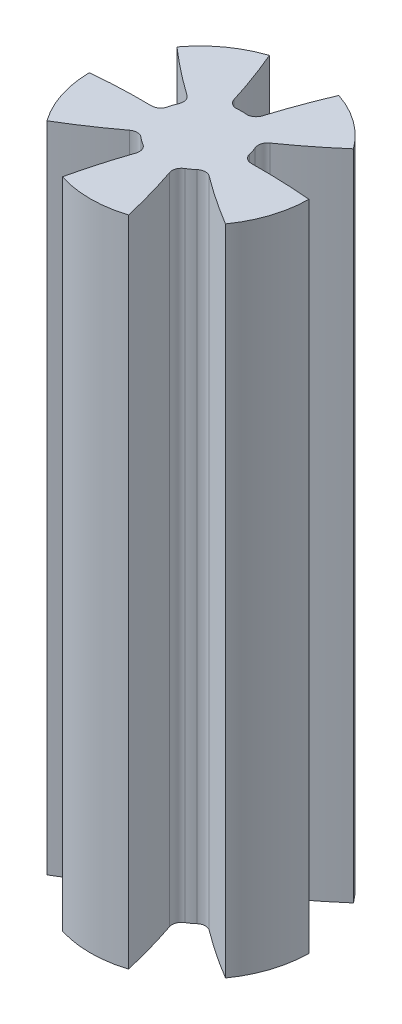
ISO-10303-21;
HEADER;
FILE_DESCRIPTION(('STEP AP214'),'2;1');
FILE_NAME('part.step','',(''),(''),'','','');
FILE_SCHEMA(('AUTOMOTIVE_DESIGN { 1 0 10303 214 1 1 1 1 }'));
ENDSEC;
DATA;
#1=APPLICATION_CONTEXT('core data for automotive mechanical design processes');
#2=APPLICATION_PROTOCOL_DEFINITION('international standard','automotive_design',2000,#1);
#3=PRODUCT_CONTEXT('',#1,'mechanical');
#4=PRODUCT('Part','Part','',(#3));
#5=PRODUCT_RELATED_PRODUCT_CATEGORY('part','',(#4));
#6=PRODUCT_DEFINITION_FORMATION('','',#4);
#7=PRODUCT_DEFINITION_CONTEXT('part definition',#1,'design');
#8=PRODUCT_DEFINITION('design','',#6,#7);
#9=PRODUCT_DEFINITION_SHAPE('','',#8);
#10=(LENGTH_UNIT() NAMED_UNIT(*) SI_UNIT(.MILLI.,.METRE.));
#11=(NAMED_UNIT(*) PLANE_ANGLE_UNIT() SI_UNIT($,.RADIAN.));
#12=(NAMED_UNIT(*) SI_UNIT($,.STERADIAN.) SOLID_ANGLE_UNIT());
#13=UNCERTAINTY_MEASURE_WITH_UNIT(LENGTH_MEASURE(1.E-05),#10,'distance_accuracy_value','');
#14=(GEOMETRIC_REPRESENTATION_CONTEXT(3) GLOBAL_UNCERTAINTY_ASSIGNED_CONTEXT((#13)) GLOBAL_UNIT_ASSIGNED_CONTEXT((#10,
#11,#12)) REPRESENTATION_CONTEXT('',''));
#15=CARTESIAN_POINT('',(0.,0.,0.));
#16=DIRECTION('',(0.,0.,1.));
#17=DIRECTION('',(1.,0.,0.));
#18=AXIS2_PLACEMENT_3D('',#15,#16,#17);
#19=CARTESIAN_POINT('',(0.,15.,0.));
#20=DIRECTION('',(0.,1.,0.));
#21=DIRECTION('',(0.,0.,1.));
#22=AXIS2_PLACEMENT_3D('',#19,#20,#21);
#23=PLANE('',#22);
#24=CARTESIAN_POINT('',(2.68452873255668,15.,26.1539844267962));
#25=DIRECTION('',(0.,-1.,0.));
#26=DIRECTION('',(-0.95105651629515,0.,0.309016994374958));
#27=AXIS2_PLACEMENT_3D('',#24,#25,#26);
#28=CIRCLE('',#27,26.2211974538354);
#29=CARTESIAN_POINT('',(2.30365048912797,15.,-0.0644466413799276));
#30=VERTEX_POINT('',#29);
#31=CARTESIAN_POINT('',(5.03985076594329,15.,0.0387847524290857));
#32=VERTEX_POINT('',#31);
#33=EDGE_CURVE('E376',#30,#32,#28,.T.);
#34=ORIENTED_EDGE('',*,*,#33,.F.);
#35=CARTESIAN_POINT('',(2.2974044873974,15.,-0.494401275571003));
#36=DIRECTION('',(0.,1.,0.));
#37=DIRECTION('',(0.,0.,1.));
#38=AXIS2_PLACEMENT_3D('',#35,#36,#37);
#39=CIRCLE('',#38,0.43);
#40=CARTESIAN_POINT('',(1.87702834715023,15.,-0.403936361317588));
#41=VERTEX_POINT('',#40);
#42=EDGE_CURVE('E350',#30,#41,#39,.F.);
#43=ORIENTED_EDGE('',*,*,#42,.T.);
#44=CARTESIAN_POINT('',(0.,15.,0.));
#45=DIRECTION('',(0.,-1.,0.));
#46=DIRECTION('',(-0.95105651629515,0.,0.309016994374958));
#47=AXIS2_PLACEMENT_3D('',#44,#45,#46);
#48=CIRCLE('',#47,1.92);
#49=CARTESIAN_POINT('',(1.75597566781519,15.,-0.776498199637955));
#50=VERTEX_POINT('',#49);
#51=EDGE_CURVE('E374',#50,#41,#48,.T.);
#52=ORIENTED_EDGE('',*,*,#51,.F.);
#53=CARTESIAN_POINT('',(2.14924105175297,15.,-0.950401442265205));
#54=DIRECTION('',(0.,1.,0.));
#55=DIRECTION('',(0.,0.,1.));
#56=AXIS2_PLACEMENT_3D('',#53,#54,#55);
#57=CIRCLE('',#56,0.43);
#58=CARTESIAN_POINT('',(1.90157318016757,15.,-1.30191335583906));
#59=VERTEX_POINT('',#58);
#60=EDGE_CURVE('E43',#50,#59,#57,.F.);
#61=ORIENTED_EDGE('',*,*,#60,.T.);
#62=CARTESIAN_POINT('',(-13.2010969682322,15.,-22.7369442702478));
#63=DIRECTION('',(0.,-1.,0.));
#64=DIRECTION('',(0.95105651629515,0.,-0.309016994374958));
#65=AXIS2_PLACEMENT_3D('',#62,#63,#64);
#66=CIRCLE('',#65,26.2211974538354);
#67=CARTESIAN_POINT('',(4.05452781327001,15.,-2.99372747781423));
#68=VERTEX_POINT('',#67);
#69=EDGE_CURVE('E380',#68,#59,#66,.T.);
#70=ORIENTED_EDGE('',*,*,#69,.F.);
#71=CARTESIAN_POINT('',(0.,15.,0.));
#72=DIRECTION('',(0.,1.,0.));
#73=DIRECTION('',(0.,0.,1.));
#74=AXIS2_PLACEMENT_3D('',#71,#72,#73);
#75=CIRCLE('',#74,5.04);
#76=CARTESIAN_POINT('',(1.5942860273207,15.,-4.78119776448225));
#77=VERTEX_POINT('',#76);
#78=EDGE_CURVE('E263',#68,#77,#75,.T.);
#79=ORIENTED_EDGE('',*,*,#78,.T.);
#80=CARTESIAN_POINT('',(25.7034823164343,15.,5.52888711421844));
#81=DIRECTION('',(0.,-1.,0.));
#82=DIRECTION('',(0.,0.,1.));
#83=AXIS2_PLACEMENT_3D('',#80,#81,#82);
#84=CIRCLE('',#83,26.2211974538354);
#85=CARTESIAN_POINT('',(0.650574752003009,15.,-2.21081691636845));
#86=VERTEX_POINT('',#85);
#87=EDGE_CURVE('E412',#86,#77,#84,.T.);
#88=ORIENTED_EDGE('',*,*,#87,.F.);
#89=CARTESIAN_POINT('',(0.239733474762643,15.,-2.33773990449711));
#90=DIRECTION('',(0.,1.,0.));
#91=DIRECTION('',(0.,0.,1.));
#92=AXIS2_PLACEMENT_3D('',#89,#90,#91);
#93=CIRCLE('',#92,0.43);
#94=CARTESIAN_POINT('',(0.19586734959331,15.,-1.90998324112106));
#95=VERTEX_POINT('',#94);
#96=EDGE_CURVE('E281',#86,#95,#93,.F.);
#97=ORIENTED_EDGE('',*,*,#96,.T.);
#98=CARTESIAN_POINT('',(0.,15.,0.));
#99=DIRECTION('',(0.,-1.,0.));
#100=DIRECTION('',(0.,0.,1.));
#101=AXIS2_PLACEMENT_3D('',#98,#99,#100);
#102=CIRCLE('',#101,1.92);
#103=CARTESIAN_POINT('',(-0.195867349593315,15.,-1.90998324112106));
#104=VERTEX_POINT('',#103);
#105=EDGE_CURVE('E421',#104,#95,#102,.T.);
#106=ORIENTED_EDGE('',*,*,#105,.F.);
#107=CARTESIAN_POINT('',(-0.239733474762651,15.,-2.33773990449713));
#108=DIRECTION('',(0.,1.,0.));
#109=DIRECTION('',(0.,0.,1.));
#110=AXIS2_PLACEMENT_3D('',#107,#108,#109);
#111=CIRCLE('',#110,0.43);
#112=CARTESIAN_POINT('',(-0.650574752003016,15.,-2.21081691636847));
#113=VERTEX_POINT('',#112);
#114=EDGE_CURVE('E285',#104,#113,#111,.F.);
#115=ORIENTED_EDGE('',*,*,#114,.T.);
#116=CARTESIAN_POINT('',(-25.7034823164343,15.,5.52888711421844));
#117=DIRECTION('',(0.,-1.,0.));
#118=DIRECTION('',(0.,0.,-1.));
#119=AXIS2_PLACEMENT_3D('',#116,#117,#118);
#120=CIRCLE('',#119,26.2211974538354);
#121=CARTESIAN_POINT('',(-1.5942860273207,15.,-4.78119776448225));
#122=VERTEX_POINT('',#121);
#123=EDGE_CURVE('E406',#122,#113,#120,.T.);
#124=ORIENTED_EDGE('',*,*,#123,.F.);
#125=CARTESIAN_POINT('',(-4.05452781327006,15.,-2.99372747781418));
#126=VERTEX_POINT('',#125);
#127=EDGE_CURVE('E269',#122,#126,#75,.T.);
#128=ORIENTED_EDGE('',*,*,#127,.T.);
#129=CARTESIAN_POINT('',(13.2010969682318,15.,-22.736944270248));
#130=DIRECTION('',(0.,-1.,0.));
#131=DIRECTION('',(0.951056516295155,0.,0.309016994374945));
#132=AXIS2_PLACEMENT_3D('',#129,#130,#131);
#133=CIRCLE('',#132,26.2211974538354);
#134=CARTESIAN_POINT('',(-1.90157318016758,15.,-1.30191335583903));
#135=VERTEX_POINT('',#134);
#136=EDGE_CURVE('E392',#135,#126,#133,.T.);
#137=ORIENTED_EDGE('',*,*,#136,.F.);
#138=CARTESIAN_POINT('',(-2.14924105175297,15.,-0.950401442265166));
#139=DIRECTION('',(0.,1.,0.));
#140=DIRECTION('',(0.,0.,1.));
#141=AXIS2_PLACEMENT_3D('',#138,#139,#140);
#142=CIRCLE('',#141,0.43);
#143=CARTESIAN_POINT('',(-1.75597566781521,15.,-0.776498199637929));
#144=VERTEX_POINT('',#143);
#145=EDGE_CURVE('E299',#135,#144,#142,.F.);
#146=ORIENTED_EDGE('',*,*,#145,.T.);
#147=CARTESIAN_POINT('',(0.,15.,0.));
#148=DIRECTION('',(0.,-1.,0.));
#149=DIRECTION('',(0.951056516295155,0.,0.309016994374945));
#150=AXIS2_PLACEMENT_3D('',#147,#148,#149);
#151=CIRCLE('',#150,1.92);
#152=CARTESIAN_POINT('',(-1.87702834715023,15.,-0.403936361317555));
#153=VERTEX_POINT('',#152);
#154=EDGE_CURVE('E399',#153,#144,#151,.T.);
#155=ORIENTED_EDGE('',*,*,#154,.F.);
#156=CARTESIAN_POINT('',(-2.29740448739742,15.,-0.494401275570966));
#157=DIRECTION('',(0.,1.,0.));
#158=DIRECTION('',(0.,0.,1.));
#159=AXIS2_PLACEMENT_3D('',#156,#157,#158);
#160=CIRCLE('',#159,0.43);
#161=CARTESIAN_POINT('',(-2.30365048912799,15.,-0.0644466413798964));
#162=VERTEX_POINT('',#161);
#163=EDGE_CURVE('E303',#153,#162,#160,.F.);
#164=ORIENTED_EDGE('',*,*,#163,.T.);
#165=CARTESIAN_POINT('',(-2.68452873255631,15.,26.1539844267963));
#166=DIRECTION('',(0.,-1.,0.));
#167=DIRECTION('',(-0.951056516295155,0.,-0.309016994374945));
#168=AXIS2_PLACEMENT_3D('',#165,#166,#167);
#169=CIRCLE('',#168,26.2211974538354);
#170=CARTESIAN_POINT('',(-5.03985076594328,15.,0.0387847524291563));
#171=VERTEX_POINT('',#170);
#172=EDGE_CURVE('E254',#171,#162,#169,.T.);
#173=ORIENTED_EDGE('',*,*,#172,.F.);
#174=CARTESIAN_POINT('',(-4.10012202425336,15.,2.93097243013861));
#175=VERTEX_POINT('',#174);
#176=EDGE_CURVE('E441',#171,#175,#75,.T.);
#177=ORIENTED_EDGE('',*,*,#176,.T.);
#178=CARTESIAN_POINT('',(-17.5447557012839,15.,-19.5810914735437));
#179=DIRECTION('',(0.,-1.,0.));
#180=DIRECTION('',(0.587785252292469,0.,-0.809016994374951));
#181=AXIS2_PLACEMENT_3D('',#178,#179,#180);
#182=CIRCLE('',#181,26.2211974538354);
#183=CARTESIAN_POINT('',(-1.82581160944179,15.,1.4061902120525));
#184=VERTEX_POINT('',#183);
#185=EDGE_CURVE('E250',#184,#175,#182,.T.);
#186=ORIENTED_EDGE('',*,*,#185,.F.);
#187=CARTESIAN_POINT('',(-1.56803749476254,15.,1.75035951022033));
#188=DIRECTION('',(0.,1.,0.));
#189=DIRECTION('',(0.,0.,1.));
#190=AXIS2_PLACEMENT_3D('',#187,#188,#189);
#191=CIRCLE('',#190,0.43);
#192=CARTESIAN_POINT('',(-1.28111999572089,15.,1.43008096154172));
#193=VERTEX_POINT('',#192);
#194=EDGE_CURVE('E316',#184,#193,#191,.F.);
#195=ORIENTED_EDGE('',*,*,#194,.T.);
#196=CARTESIAN_POINT('',(0.,15.,0.));
#197=DIRECTION('',(0.,-1.,0.));
#198=DIRECTION('',(0.587785252292469,0.,-0.809016994374951));
#199=AXIS2_PLACEMENT_3D('',#196,#197,#198);
#200=CIRCLE('',#199,1.92);
#201=CARTESIAN_POINT('',(-0.964199966792555,15.,1.66033684053485));
#202=VERTEX_POINT('',#201);
#203=EDGE_CURVE('E466',#202,#193,#200,.T.);
#204=ORIENTED_EDGE('',*,*,#203,.F.);
#205=CARTESIAN_POINT('',(-1.18014058435547,15.,2.03218311211296));
#206=DIRECTION('',(0.,1.,0.));
#207=DIRECTION('',(0.,0.,1.));
#208=AXIS2_PLACEMENT_3D('',#205,#206,#207);
#209=CIRCLE('',#208,0.43);
#210=CARTESIAN_POINT('',(-0.773159548478394,15.,2.17098670153492));
#211=VERTEX_POINT('',#210);
#212=EDGE_CURVE('E319',#202,#211,#209,.F.);
#213=ORIENTED_EDGE('',*,*,#212,.T.);
#214=CARTESIAN_POINT('',(24.0443523159388,15.,10.6351642027769));
#215=DIRECTION('',(0.,-1.,0.));
#216=DIRECTION('',(-0.587785252292469,0.,0.809016994374951));
#217=AXIS2_PLACEMENT_3D('',#214,#215,#216);
#218=CIRCLE('',#217,26.2211974538354);
#219=CARTESIAN_POINT('',(-1.52051304425941,15.,4.80516805972871));
#220=VERTEX_POINT('',#219);
#221=EDGE_CURVE('E454',#220,#211,#218,.T.);
#222=ORIENTED_EDGE('',*,*,#221,.F.);
#223=CARTESIAN_POINT('',(1.52051304425948,15.,4.8051680597287));
#224=VERTEX_POINT('',#223);
#225=EDGE_CURVE('E442',#220,#224,#75,.T.);
#226=ORIENTED_EDGE('',*,*,#225,.T.);
#227=CARTESIAN_POINT('',(-24.0443523159387,15.,10.6351642027773));
#228=DIRECTION('',(0.,-1.,0.));
#229=DIRECTION('',(-0.58778525229248,0.,-0.809016994374942));
#230=AXIS2_PLACEMENT_3D('',#227,#228,#229);
#231=CIRCLE('',#230,26.2211974538354);
#232=CARTESIAN_POINT('',(0.773159548478414,15.,2.17098670153489));
#233=VERTEX_POINT('',#232);
#234=EDGE_CURVE('E452',#233,#224,#231,.T.);
#235=ORIENTED_EDGE('',*,*,#234,.F.);
#236=CARTESIAN_POINT('',(1.1801405843555,15.,2.03218311211293));
#237=DIRECTION('',(0.,1.,0.));
#238=DIRECTION('',(0.,0.,1.));
#239=AXIS2_PLACEMENT_3D('',#236,#237,#238);
#240=CIRCLE('',#239,0.43);
#241=CARTESIAN_POINT('',(0.964199966792582,15.,1.66033684053483));
#242=VERTEX_POINT('',#241);
#243=EDGE_CURVE('E333',#233,#242,#240,.F.);
#244=ORIENTED_EDGE('',*,*,#243,.T.);
#245=CARTESIAN_POINT('',(0.,15.,0.));
#246=DIRECTION('',(0.,-1.,0.));
#247=DIRECTION('',(-0.58778525229248,0.,-0.809016994374942));
#248=AXIS2_PLACEMENT_3D('',#245,#246,#247);
#249=CIRCLE('',#248,1.92);
#250=CARTESIAN_POINT('',(1.28111999572092,15.,1.4300809615417));
#251=VERTEX_POINT('',#250);
#252=EDGE_CURVE('E552',#251,#242,#249,.T.);
#253=ORIENTED_EDGE('',*,*,#252,.F.);
#254=CARTESIAN_POINT('',(1.56803749476258,15.,1.75035951022031));
#255=DIRECTION('',(0.,1.,0.));
#256=DIRECTION('',(0.,0.,1.));
#257=AXIS2_PLACEMENT_3D('',#254,#255,#256);
#258=CIRCLE('',#257,0.43);
#259=CARTESIAN_POINT('',(1.82581160944182,15.,1.40619021205249));
#260=VERTEX_POINT('',#259);
#261=EDGE_CURVE('E337',#251,#260,#258,.F.);
#262=ORIENTED_EDGE('',*,*,#261,.T.);
#263=CARTESIAN_POINT('',(17.5447557012836,15.,-19.581091473544));
#264=DIRECTION('',(0.,-1.,0.));
#265=DIRECTION('',(0.58778525229248,0.,0.809016994374942));
#266=AXIS2_PLACEMENT_3D('',#263,#264,#265);
#267=CIRCLE('',#266,26.2211974538354);
#268=CARTESIAN_POINT('',(4.1001220242534,15.,2.93097243013855));
#269=VERTEX_POINT('',#268);
#270=EDGE_CURVE('E387',#269,#260,#267,.T.);
#271=ORIENTED_EDGE('',*,*,#270,.F.);
#272=EDGE_CURVE('E443',#269,#32,#75,.T.);
#273=ORIENTED_EDGE('',*,*,#272,.T.);
#274=EDGE_LOOP('',(#34,#43,#52,#61,#70,#79,#88,#97,#106,#115,#124,#128,#137,#146,#155,#164,#173,
#177,#186,#195,#204,#213,#222,#226,#235,#244,#253,#262,#271,#273));
#275=FACE_BOUND('',#274,.T.);
#276=ADVANCED_FACE('F35',(#275),#23,.T.);
#277=CARTESIAN_POINT('',(0.,-15.,0.));
#278=DIRECTION('',(0.,1.,0.));
#279=DIRECTION('',(0.,0.,1.));
#280=AXIS2_PLACEMENT_3D('',#277,#278,#279);
#281=PLANE('',#280);
#282=CARTESIAN_POINT('',(-13.2010969682322,-15.,-22.7369442702478));
#283=DIRECTION('',(0.,-1.,0.));
#284=DIRECTION('',(0.95105651629515,0.,-0.309016994374958));
#285=AXIS2_PLACEMENT_3D('',#282,#283,#284);
#286=CIRCLE('',#285,26.2211974538354);
#287=CARTESIAN_POINT('',(4.05452781327001,-15.,-2.99372747781423));
#288=VERTEX_POINT('',#287);
#289=CARTESIAN_POINT('',(1.90157318016757,-15.,-1.30191335583906));
#290=VERTEX_POINT('',#289);
#291=EDGE_CURVE('E382',#288,#290,#286,.T.);
#292=ORIENTED_EDGE('',*,*,#291,.T.);
#293=CARTESIAN_POINT('',(2.14924105175297,-15.,-0.950401442265205));
#294=DIRECTION('',(0.,1.,0.));
#295=DIRECTION('',(0.,0.,1.));
#296=AXIS2_PLACEMENT_3D('',#293,#294,#295);
#297=CIRCLE('',#296,0.43);
#298=CARTESIAN_POINT('',(1.75597566781519,-15.,-0.776498199637955));
#299=VERTEX_POINT('',#298);
#300=EDGE_CURVE('E11',#290,#299,#297,.T.);
#301=ORIENTED_EDGE('',*,*,#300,.T.);
#302=CARTESIAN_POINT('',(0.,-15.,0.));
#303=DIRECTION('',(0.,-1.,0.));
#304=DIRECTION('',(-0.95105651629515,0.,0.309016994374958));
#305=AXIS2_PLACEMENT_3D('',#302,#303,#304);
#306=CIRCLE('',#305,1.92);
#307=CARTESIAN_POINT('',(1.87702834715023,-15.,-0.403936361317588));
#308=VERTEX_POINT('',#307);
#309=EDGE_CURVE('E360',#299,#308,#306,.T.);
#310=ORIENTED_EDGE('',*,*,#309,.T.);
#311=CARTESIAN_POINT('',(2.2974044873974,-15.,-0.494401275571003));
#312=DIRECTION('',(0.,1.,0.));
#313=DIRECTION('',(0.,0.,1.));
#314=AXIS2_PLACEMENT_3D('',#311,#312,#313);
#315=CIRCLE('',#314,0.43);
#316=CARTESIAN_POINT('',(2.30365048912797,-15.,-0.0644466413799276));
#317=VERTEX_POINT('',#316);
#318=EDGE_CURVE('E352',#308,#317,#315,.T.);
#319=ORIENTED_EDGE('',*,*,#318,.T.);
#320=CARTESIAN_POINT('',(2.68452873255668,-15.,26.1539844267962));
#321=DIRECTION('',(0.,-1.,0.));
#322=DIRECTION('',(-0.95105651629515,0.,0.309016994374958));
#323=AXIS2_PLACEMENT_3D('',#320,#321,#322);
#324=CIRCLE('',#323,26.2211974538354);
#325=CARTESIAN_POINT('',(5.03985076594329,-15.,0.0387847524290857));
#326=VERTEX_POINT('',#325);
#327=EDGE_CURVE('E357',#317,#326,#324,.T.);
#328=ORIENTED_EDGE('',*,*,#327,.T.);
#329=CARTESIAN_POINT('',(0.,-15.,0.));
#330=DIRECTION('',(0.,1.,0.));
#331=DIRECTION('',(0.,0.,1.));
#332=AXIS2_PLACEMENT_3D('',#329,#330,#331);
#333=CIRCLE('',#332,5.04);
#334=CARTESIAN_POINT('',(4.10012202425339,-15.,2.93097243013854));
#335=VERTEX_POINT('',#334);
#336=EDGE_CURVE('E266',#335,#326,#333,.T.);
#337=ORIENTED_EDGE('',*,*,#336,.F.);
#338=CARTESIAN_POINT('',(17.5447557012836,-15.,-19.581091473544));
#339=DIRECTION('',(0.,-1.,0.));
#340=DIRECTION('',(0.58778525229248,0.,0.809016994374942));
#341=AXIS2_PLACEMENT_3D('',#338,#339,#340);
#342=CIRCLE('',#341,26.2211974538354);
#343=CARTESIAN_POINT('',(1.82581160944182,-15.,1.40619021205249));
#344=VERTEX_POINT('',#343);
#345=EDGE_CURVE('E540',#335,#344,#342,.T.);
#346=ORIENTED_EDGE('',*,*,#345,.T.);
#347=CARTESIAN_POINT('',(1.56803749476258,-15.,1.75035951022031));
#348=DIRECTION('',(0.,1.,0.));
#349=DIRECTION('',(0.,0.,1.));
#350=AXIS2_PLACEMENT_3D('',#347,#348,#349);
#351=CIRCLE('',#350,0.43);
#352=CARTESIAN_POINT('',(1.28111999572092,-15.,1.4300809615417));
#353=VERTEX_POINT('',#352);
#354=EDGE_CURVE('E339',#344,#353,#351,.T.);
#355=ORIENTED_EDGE('',*,*,#354,.T.);
#356=CARTESIAN_POINT('',(0.,-15.,0.));
#357=DIRECTION('',(0.,-1.,0.));
#358=DIRECTION('',(-0.58778525229248,0.,-0.809016994374942));
#359=AXIS2_PLACEMENT_3D('',#356,#357,#358);
#360=CIRCLE('',#359,1.92);
#361=CARTESIAN_POINT('',(0.964199966792582,-15.,1.66033684053483));
#362=VERTEX_POINT('',#361);
#363=EDGE_CURVE('E538',#353,#362,#360,.T.);
#364=ORIENTED_EDGE('',*,*,#363,.T.);
#365=CARTESIAN_POINT('',(1.1801405843555,-15.,2.03218311211293));
#366=DIRECTION('',(0.,1.,0.));
#367=DIRECTION('',(0.,0.,1.));
#368=AXIS2_PLACEMENT_3D('',#365,#366,#367);
#369=CIRCLE('',#368,0.43);
#370=CARTESIAN_POINT('',(0.773159548478414,-15.,2.17098670153489));
#371=VERTEX_POINT('',#370);
#372=EDGE_CURVE('E335',#362,#371,#369,.T.);
#373=ORIENTED_EDGE('',*,*,#372,.T.);
#374=CARTESIAN_POINT('',(-24.0443523159387,-15.,10.6351642027773));
#375=DIRECTION('',(0.,-1.,0.));
#376=DIRECTION('',(-0.58778525229248,0.,-0.809016994374942));
#377=AXIS2_PLACEMENT_3D('',#374,#375,#376);
#378=CIRCLE('',#377,26.2211974538354);
#379=CARTESIAN_POINT('',(1.52051304425948,-15.,4.8051680597287));
#380=VERTEX_POINT('',#379);
#381=EDGE_CURVE('E468',#371,#380,#378,.T.);
#382=ORIENTED_EDGE('',*,*,#381,.T.);
#383=CARTESIAN_POINT('',(-1.52051304425941,-15.,4.80516805972871));
#384=VERTEX_POINT('',#383);
#385=EDGE_CURVE('E260',#384,#380,#333,.T.);
#386=ORIENTED_EDGE('',*,*,#385,.F.);
#387=CARTESIAN_POINT('',(24.0443523159388,-15.,10.6351642027769));
#388=DIRECTION('',(0.,-1.,0.));
#389=DIRECTION('',(-0.587785252292469,0.,0.809016994374951));
#390=AXIS2_PLACEMENT_3D('',#387,#388,#389);
#391=CIRCLE('',#390,26.2211974538354);
#392=CARTESIAN_POINT('',(-0.773159548478394,-15.,2.17098670153492));
#393=VERTEX_POINT('',#392);
#394=EDGE_CURVE('E751',#384,#393,#391,.T.);
#395=ORIENTED_EDGE('',*,*,#394,.T.);
#396=CARTESIAN_POINT('',(-1.18014058435547,-15.,2.03218311211296));
#397=DIRECTION('',(0.,1.,0.));
#398=DIRECTION('',(0.,0.,1.));
#399=AXIS2_PLACEMENT_3D('',#396,#397,#398);
#400=CIRCLE('',#399,0.43);
#401=CARTESIAN_POINT('',(-0.964199966792555,-15.,1.66033684053485));
#402=VERTEX_POINT('',#401);
#403=EDGE_CURVE('E321',#393,#402,#400,.T.);
#404=ORIENTED_EDGE('',*,*,#403,.T.);
#405=CARTESIAN_POINT('',(0.,-15.,0.));
#406=DIRECTION('',(0.,-1.,0.));
#407=DIRECTION('',(0.587785252292469,0.,-0.809016994374951));
#408=AXIS2_PLACEMENT_3D('',#405,#406,#407);
#409=CIRCLE('',#408,1.92);
#410=CARTESIAN_POINT('',(-1.28111999572089,-15.,1.43008096154172));
#411=VERTEX_POINT('',#410);
#412=EDGE_CURVE('E244',#402,#411,#409,.T.);
#413=ORIENTED_EDGE('',*,*,#412,.T.);
#414=CARTESIAN_POINT('',(-1.56803749476254,-15.,1.75035951022033));
#415=DIRECTION('',(0.,1.,0.));
#416=DIRECTION('',(0.,0.,1.));
#417=AXIS2_PLACEMENT_3D('',#414,#415,#416);
#418=CIRCLE('',#417,0.43);
#419=CARTESIAN_POINT('',(-1.82581160944179,-15.,1.4061902120525));
#420=VERTEX_POINT('',#419);
#421=EDGE_CURVE('E239',#411,#420,#418,.T.);
#422=ORIENTED_EDGE('',*,*,#421,.T.);
#423=CARTESIAN_POINT('',(-17.5447557012839,-15.,-19.5810914735437));
#424=DIRECTION('',(0.,-1.,0.));
#425=DIRECTION('',(0.587785252292469,0.,-0.809016994374951));
#426=AXIS2_PLACEMENT_3D('',#423,#424,#425);
#427=CIRCLE('',#426,26.2211974538354);
#428=CARTESIAN_POINT('',(-4.10012202425336,-15.,2.93097243013861));
#429=VERTEX_POINT('',#428);
#430=EDGE_CURVE('E231',#420,#429,#427,.T.);
#431=ORIENTED_EDGE('',*,*,#430,.T.);
#432=CARTESIAN_POINT('',(-5.03985076594327,-15.,0.0387847524291563));
#433=VERTEX_POINT('',#432);
#434=EDGE_CURVE('E236',#433,#429,#333,.T.);
#435=ORIENTED_EDGE('',*,*,#434,.F.);
#436=CARTESIAN_POINT('',(-2.68452873255631,-15.,26.1539844267963));
#437=DIRECTION('',(0.,-1.,0.));
#438=DIRECTION('',(-0.951056516295155,0.,-0.309016994374945));
#439=AXIS2_PLACEMENT_3D('',#436,#437,#438);
#440=CIRCLE('',#439,26.2211974538354);
#441=CARTESIAN_POINT('',(-2.30365048912799,-15.,-0.0644466413798964));
#442=VERTEX_POINT('',#441);
#443=EDGE_CURVE('E389',#433,#442,#440,.T.);
#444=ORIENTED_EDGE('',*,*,#443,.T.);
#445=CARTESIAN_POINT('',(-2.29740448739742,-15.,-0.494401275570966));
#446=DIRECTION('',(0.,1.,0.));
#447=DIRECTION('',(0.,0.,1.));
#448=AXIS2_PLACEMENT_3D('',#445,#446,#447);
#449=CIRCLE('',#448,0.43);
#450=CARTESIAN_POINT('',(-1.87702834715023,-15.,-0.403936361317555));
#451=VERTEX_POINT('',#450);
#452=EDGE_CURVE('E305',#442,#451,#449,.T.);
#453=ORIENTED_EDGE('',*,*,#452,.T.);
#454=CARTESIAN_POINT('',(0.,-15.,0.));
#455=DIRECTION('',(0.,-1.,0.));
#456=DIRECTION('',(0.951056516295155,0.,0.309016994374945));
#457=AXIS2_PLACEMENT_3D('',#454,#455,#456);
#458=CIRCLE('',#457,1.92);
#459=CARTESIAN_POINT('',(-1.75597566781521,-15.,-0.776498199637929));
#460=VERTEX_POINT('',#459);
#461=EDGE_CURVE('E391',#451,#460,#458,.T.);
#462=ORIENTED_EDGE('',*,*,#461,.T.);
#463=CARTESIAN_POINT('',(-2.14924105175297,-15.,-0.950401442265166));
#464=DIRECTION('',(0.,1.,0.));
#465=DIRECTION('',(0.,0.,1.));
#466=AXIS2_PLACEMENT_3D('',#463,#464,#465);
#467=CIRCLE('',#466,0.43);
#468=CARTESIAN_POINT('',(-1.90157318016758,-15.,-1.30191335583903));
#469=VERTEX_POINT('',#468);
#470=EDGE_CURVE('E301',#460,#469,#467,.T.);
#471=ORIENTED_EDGE('',*,*,#470,.T.);
#472=CARTESIAN_POINT('',(13.2010969682318,-15.,-22.736944270248));
#473=DIRECTION('',(0.,-1.,0.));
#474=DIRECTION('',(0.951056516295155,0.,0.309016994374945));
#475=AXIS2_PLACEMENT_3D('',#472,#473,#474);
#476=CIRCLE('',#475,26.2211974538354);
#477=CARTESIAN_POINT('',(-4.05452781327006,-15.,-2.99372747781418));
#478=VERTEX_POINT('',#477);
#479=EDGE_CURVE('E395',#469,#478,#476,.T.);
#480=ORIENTED_EDGE('',*,*,#479,.T.);
#481=CARTESIAN_POINT('',(-1.5942860273207,-15.,-4.78119776448225));
#482=VERTEX_POINT('',#481);
#483=EDGE_CURVE('E259',#482,#478,#333,.T.);
#484=ORIENTED_EDGE('',*,*,#483,.F.);
#485=CARTESIAN_POINT('',(-25.7034823164343,-15.,5.52888711421844));
#486=DIRECTION('',(0.,-1.,0.));
#487=DIRECTION('',(0.,0.,-1.));
#488=AXIS2_PLACEMENT_3D('',#485,#486,#487);
#489=CIRCLE('',#488,26.2211974538354);
#490=CARTESIAN_POINT('',(-0.650574752003016,-15.,-2.21081691636847));
#491=VERTEX_POINT('',#490);
#492=EDGE_CURVE('E408',#482,#491,#489,.T.);
#493=ORIENTED_EDGE('',*,*,#492,.T.);
#494=CARTESIAN_POINT('',(-0.239733474762651,-15.,-2.33773990449713));
#495=DIRECTION('',(0.,1.,0.));
#496=DIRECTION('',(0.,0.,1.));
#497=AXIS2_PLACEMENT_3D('',#494,#495,#496);
#498=CIRCLE('',#497,0.43);
#499=CARTESIAN_POINT('',(-0.195867349593315,-15.,-1.90998324112106));
#500=VERTEX_POINT('',#499);
#501=EDGE_CURVE('E287',#491,#500,#498,.T.);
#502=ORIENTED_EDGE('',*,*,#501,.T.);
#503=CARTESIAN_POINT('',(0.,-15.,0.));
#504=DIRECTION('',(0.,-1.,0.));
#505=DIRECTION('',(0.,0.,1.));
#506=AXIS2_PLACEMENT_3D('',#503,#504,#505);
#507=CIRCLE('',#506,1.92);
#508=CARTESIAN_POINT('',(0.19586734959331,-15.,-1.90998324112106));
#509=VERTEX_POINT('',#508);
#510=EDGE_CURVE('E411',#500,#509,#507,.T.);
#511=ORIENTED_EDGE('',*,*,#510,.T.);
#512=CARTESIAN_POINT('',(0.239733474762643,-15.,-2.33773990449711));
#513=DIRECTION('',(0.,1.,0.));
#514=DIRECTION('',(0.,0.,1.));
#515=AXIS2_PLACEMENT_3D('',#512,#513,#514);
#516=CIRCLE('',#515,0.43);
#517=CARTESIAN_POINT('',(0.650574752003009,-15.,-2.21081691636845));
#518=VERTEX_POINT('',#517);
#519=EDGE_CURVE('E283',#509,#518,#516,.T.);
#520=ORIENTED_EDGE('',*,*,#519,.T.);
#521=CARTESIAN_POINT('',(25.7034823164343,-15.,5.52888711421844));
#522=DIRECTION('',(0.,-1.,0.));
#523=DIRECTION('',(0.,0.,1.));
#524=AXIS2_PLACEMENT_3D('',#521,#522,#523);
#525=CIRCLE('',#524,26.2211974538354);
#526=CARTESIAN_POINT('',(1.5942860273207,-15.,-4.78119776448225));
#527=VERTEX_POINT('',#526);
#528=EDGE_CURVE('E415',#518,#527,#525,.T.);
#529=ORIENTED_EDGE('',*,*,#528,.T.);
#530=EDGE_CURVE('E264',#288,#527,#333,.T.);
#531=ORIENTED_EDGE('',*,*,#530,.F.);
#532=EDGE_LOOP('',(#292,#301,#310,#319,#328,#337,#346,#355,#364,#373,#382,#386,#395,#404,#413,
#422,#431,#435,#444,#453,#462,#471,#480,#484,#493,#502,#511,#520,#529,#531));
#533=FACE_BOUND('',#532,.T.);
#534=ADVANCED_FACE('F233',(#533),#281,.F.);
#535=CARTESIAN_POINT('',(0.,15.,0.));
#536=DIRECTION('',(0.,-1.,0.));
#537=DIRECTION('',(0.,0.,-1.));
#538=AXIS2_PLACEMENT_3D('',#535,#536,#537);
#539=CYLINDRICAL_SURFACE('',#538,5.04);
#540=ORIENTED_EDGE('',*,*,#336,.T.);
#541=DIRECTION('',(0.,1.,0.));
#542=VECTOR('',#541,1.);
#543=CARTESIAN_POINT('',(5.03985076594329,-15.,0.0387847524290857));
#544=LINE('',#543,#542);
#545=EDGE_CURVE('E368',#326,#32,#544,.T.);
#546=ORIENTED_EDGE('',*,*,#545,.T.);
#547=ORIENTED_EDGE('',*,*,#272,.F.);
#548=DIRECTION('',(0.,1.,0.));
#549=VECTOR('',#548,1.);
#550=CARTESIAN_POINT('',(4.1001220242534,-15.,2.93097243013855));
#551=LINE('',#550,#549);
#552=EDGE_CURVE('E464',#335,#269,#551,.T.);
#553=ORIENTED_EDGE('',*,*,#552,.F.);
#554=EDGE_LOOP('',(#540,#546,#547,#553));
#555=FACE_BOUND('',#554,.T.);
#556=ADVANCED_FACE('F488',(#555),#539,.T.);
#557=ORIENTED_EDGE('',*,*,#385,.T.);
#558=DIRECTION('',(0.,1.,0.));
#559=VECTOR('',#558,1.);
#560=CARTESIAN_POINT('',(1.52051304425948,-15.,4.8051680597287));
#561=LINE('',#560,#559);
#562=EDGE_CURVE('E461',#380,#224,#561,.T.);
#563=ORIENTED_EDGE('',*,*,#562,.T.);
#564=ORIENTED_EDGE('',*,*,#225,.F.);
#565=DIRECTION('',(0.,1.,0.));
#566=VECTOR('',#565,1.);
#567=CARTESIAN_POINT('',(-1.52051304425941,-15.,4.80516805972871));
#568=LINE('',#567,#566);
#569=EDGE_CURVE('E243',#384,#220,#568,.T.);
#570=ORIENTED_EDGE('',*,*,#569,.F.);
#571=EDGE_LOOP('',(#557,#563,#564,#570));
#572=FACE_BOUND('',#571,.T.);
#573=ADVANCED_FACE('F458',(#572),#539,.T.);
#574=ORIENTED_EDGE('',*,*,#434,.T.);
#575=DIRECTION('',(0.,1.,0.));
#576=VECTOR('',#575,1.);
#577=CARTESIAN_POINT('',(-4.10012202425336,-15.,2.93097243013861));
#578=LINE('',#577,#576);
#579=EDGE_CURVE('E247',#429,#175,#578,.T.);
#580=ORIENTED_EDGE('',*,*,#579,.T.);
#581=ORIENTED_EDGE('',*,*,#176,.F.);
#582=DIRECTION('',(0.,1.,0.));
#583=VECTOR('',#582,1.);
#584=CARTESIAN_POINT('',(-5.03985076594328,-15.,0.0387847524291563));
#585=LINE('',#584,#583);
#586=EDGE_CURVE('E258',#433,#171,#585,.T.);
#587=ORIENTED_EDGE('',*,*,#586,.F.);
#588=EDGE_LOOP('',(#574,#580,#581,#587));
#589=FACE_BOUND('',#588,.T.);
#590=ADVANCED_FACE('F257',(#589),#539,.T.);
#591=ORIENTED_EDGE('',*,*,#483,.T.);
#592=DIRECTION('',(0.,1.,0.));
#593=VECTOR('',#592,1.);
#594=CARTESIAN_POINT('',(-4.05452781327006,-15.,-2.99372747781418));
#595=LINE('',#594,#593);
#596=EDGE_CURVE('E403',#478,#126,#595,.T.);
#597=ORIENTED_EDGE('',*,*,#596,.T.);
#598=ORIENTED_EDGE('',*,*,#127,.F.);
#599=DIRECTION('',(0.,1.,0.));
#600=VECTOR('',#599,1.);
#601=CARTESIAN_POINT('',(-1.5942860273207,-15.,-4.78119776448225));
#602=LINE('',#601,#600);
#603=EDGE_CURVE('E418',#482,#122,#602,.T.);
#604=ORIENTED_EDGE('',*,*,#603,.F.);
#605=EDGE_LOOP('',(#591,#597,#598,#604));
#606=FACE_BOUND('',#605,.T.);
#607=ADVANCED_FACE('F439',(#606),#539,.T.);
#608=ORIENTED_EDGE('',*,*,#78,.F.);
#609=DIRECTION('',(0.,1.,0.));
#610=VECTOR('',#609,1.);
#611=CARTESIAN_POINT('',(4.05452781327001,-15.,-2.99372747781423));
#612=LINE('',#611,#610);
#613=EDGE_CURVE('E370',#288,#68,#612,.T.);
#614=ORIENTED_EDGE('',*,*,#613,.F.);
#615=ORIENTED_EDGE('',*,*,#530,.T.);
#616=DIRECTION('',(0.,1.,0.));
#617=VECTOR('',#616,1.);
#618=CARTESIAN_POINT('',(1.5942860273207,-15.,-4.78119776448225));
#619=LINE('',#618,#617);
#620=EDGE_CURVE('E426',#527,#77,#619,.T.);
#621=ORIENTED_EDGE('',*,*,#620,.T.);
#622=EDGE_LOOP('',(#608,#614,#615,#621));
#623=FACE_BOUND('',#622,.T.);
#624=ADVANCED_FACE('F493',(#623),#539,.T.);
#625=CARTESIAN_POINT('',(25.7034823164343,-15.,5.52888711421844));
#626=DIRECTION('',(0.,1.,0.));
#627=DIRECTION('',(0.,0.,1.));
#628=AXIS2_PLACEMENT_3D('',#625,#626,#627);
#629=CYLINDRICAL_SURFACE('',#628,26.2211974538354);
#630=ORIENTED_EDGE('',*,*,#528,.F.);
#631=DIRECTION('',(0.,1.,0.));
#632=VECTOR('',#631,1.);
#633=CARTESIAN_POINT('',(0.650574752003006,-15.,-2.21081691636845));
#634=LINE('',#633,#632);
#635=EDGE_CURVE('E271',#518,#86,#634,.T.);
#636=ORIENTED_EDGE('',*,*,#635,.T.);
#637=ORIENTED_EDGE('',*,*,#87,.T.);
#638=ORIENTED_EDGE('',*,*,#620,.F.);
#639=EDGE_LOOP('',(#630,#636,#637,#638));
#640=FACE_BOUND('',#639,.T.);
#641=ADVANCED_FACE('F496',(#640),#629,.T.);
#642=CARTESIAN_POINT('',(0.,-15.,0.));
#643=DIRECTION('',(0.,1.,0.));
#644=DIRECTION('',(0.,0.,1.));
#645=AXIS2_PLACEMENT_3D('',#642,#643,#644);
#646=CYLINDRICAL_SURFACE('',#645,1.92);
#647=ORIENTED_EDGE('',*,*,#105,.T.);
#648=DIRECTION('',(0.,1.,0.));
#649=VECTOR('',#648,1.);
#650=CARTESIAN_POINT('',(0.19586734959331,-15.,-1.90998324112106));
#651=LINE('',#650,#649);
#652=EDGE_CURVE('E277',#95,#509,#651,.F.);
#653=ORIENTED_EDGE('',*,*,#652,.T.);
#654=ORIENTED_EDGE('',*,*,#510,.F.);
#655=DIRECTION('',(0.,1.,0.));
#656=VECTOR('',#655,1.);
#657=CARTESIAN_POINT('',(-0.195867349593315,-15.,-1.90998324112106));
#658=LINE('',#657,#656);
#659=EDGE_CURVE('E274',#500,#104,#658,.T.);
#660=ORIENTED_EDGE('',*,*,#659,.T.);
#661=EDGE_LOOP('',(#647,#653,#654,#660));
#662=FACE_BOUND('',#661,.T.);
#663=ADVANCED_FACE('F566',(#662),#646,.T.);
#664=CARTESIAN_POINT('',(-25.7034823164343,-15.,5.52888711421844));
#665=DIRECTION('',(0.,1.,0.));
#666=DIRECTION('',(0.,0.,1.));
#667=AXIS2_PLACEMENT_3D('',#664,#665,#666);
#668=CYLINDRICAL_SURFACE('',#667,26.2211974538354);
#669=ORIENTED_EDGE('',*,*,#123,.T.);
#670=DIRECTION('',(0.,1.,0.));
#671=VECTOR('',#670,1.);
#672=CARTESIAN_POINT('',(-0.650574752003016,-15.,-2.21081691636847));
#673=LINE('',#672,#671);
#674=EDGE_CURVE('E279',#113,#491,#673,.F.);
#675=ORIENTED_EDGE('',*,*,#674,.T.);
#676=ORIENTED_EDGE('',*,*,#492,.F.);
#677=ORIENTED_EDGE('',*,*,#603,.T.);
#678=EDGE_LOOP('',(#669,#675,#676,#677));
#679=FACE_BOUND('',#678,.T.);
#680=ADVANCED_FACE('F431',(#679),#668,.T.);
#681=CARTESIAN_POINT('',(0.239733474762643,-15.,-2.33773990449711));
#682=DIRECTION('',(0.,-1.,0.));
#683=DIRECTION('',(0.,0.,-1.));
#684=AXIS2_PLACEMENT_3D('',#681,#682,#683);
#685=CYLINDRICAL_SURFACE('',#684,0.43);
#686=ORIENTED_EDGE('',*,*,#519,.F.);
#687=ORIENTED_EDGE('',*,*,#652,.F.);
#688=ORIENTED_EDGE('',*,*,#96,.F.);
#689=ORIENTED_EDGE('',*,*,#635,.F.);
#690=EDGE_LOOP('',(#686,#687,#688,#689));
#691=FACE_BOUND('',#690,.T.);
#692=ADVANCED_FACE('F498',(#691),#685,.F.);
#693=CARTESIAN_POINT('',(-0.239733474762651,-15.,-2.33773990449713));
#694=DIRECTION('',(0.,-1.,0.));
#695=DIRECTION('',(0.,0.,-1.));
#696=AXIS2_PLACEMENT_3D('',#693,#694,#695);
#697=CYLINDRICAL_SURFACE('',#696,0.43);
#698=ORIENTED_EDGE('',*,*,#501,.F.);
#699=ORIENTED_EDGE('',*,*,#674,.F.);
#700=ORIENTED_EDGE('',*,*,#114,.F.);
#701=ORIENTED_EDGE('',*,*,#659,.F.);
#702=EDGE_LOOP('',(#698,#699,#700,#701));
#703=FACE_BOUND('',#702,.T.);
#704=ADVANCED_FACE('F501',(#703),#697,.F.);
#705=CARTESIAN_POINT('',(13.2010969682318,-15.,-22.736944270248));
#706=DIRECTION('',(0.,1.,0.));
#707=DIRECTION('',(0.,0.,1.));
#708=AXIS2_PLACEMENT_3D('',#705,#706,#707);
#709=CYLINDRICAL_SURFACE('',#708,26.2211974538354);
#710=ORIENTED_EDGE('',*,*,#479,.F.);
#711=DIRECTION('',(0.,1.,0.));
#712=VECTOR('',#711,1.);
#713=CARTESIAN_POINT('',(-1.90157318016758,-15.,-1.30191335583903));
#714=LINE('',#713,#712);
#715=EDGE_CURVE('E289',#469,#135,#714,.T.);
#716=ORIENTED_EDGE('',*,*,#715,.T.);
#717=ORIENTED_EDGE('',*,*,#136,.T.);
#718=ORIENTED_EDGE('',*,*,#596,.F.);
#719=EDGE_LOOP('',(#710,#716,#717,#718));
#720=FACE_BOUND('',#719,.T.);
#721=ADVANCED_FACE('F505',(#720),#709,.T.);
#722=CARTESIAN_POINT('',(0.,-15.,0.));
#723=DIRECTION('',(0.,1.,0.));
#724=DIRECTION('',(0.,0.,1.));
#725=AXIS2_PLACEMENT_3D('',#722,#723,#724);
#726=CYLINDRICAL_SURFACE('',#725,1.92);
#727=ORIENTED_EDGE('',*,*,#154,.T.);
#728=DIRECTION('',(0.,1.,0.));
#729=VECTOR('',#728,1.);
#730=CARTESIAN_POINT('',(-1.75597566781521,-15.,-0.776498199637929));
#731=LINE('',#730,#729);
#732=EDGE_CURVE('E295',#144,#460,#731,.F.);
#733=ORIENTED_EDGE('',*,*,#732,.T.);
#734=ORIENTED_EDGE('',*,*,#461,.F.);
#735=DIRECTION('',(0.,1.,0.));
#736=VECTOR('',#735,1.);
#737=CARTESIAN_POINT('',(-1.87702834715023,-15.,-0.403936361317555));
#738=LINE('',#737,#736);
#739=EDGE_CURVE('E292',#451,#153,#738,.T.);
#740=ORIENTED_EDGE('',*,*,#739,.T.);
#741=EDGE_LOOP('',(#727,#733,#734,#740));
#742=FACE_BOUND('',#741,.T.);
#743=ADVANCED_FACE('F577',(#742),#726,.T.);
#744=CARTESIAN_POINT('',(-2.68452873255631,-15.,26.1539844267963));
#745=DIRECTION('',(0.,1.,0.));
#746=DIRECTION('',(0.,0.,1.));
#747=AXIS2_PLACEMENT_3D('',#744,#745,#746);
#748=CYLINDRICAL_SURFACE('',#747,26.2211974538354);
#749=ORIENTED_EDGE('',*,*,#172,.T.);
#750=DIRECTION('',(0.,1.,0.));
#751=VECTOR('',#750,1.);
#752=CARTESIAN_POINT('',(-2.30365048912799,-15.,-0.0644466413798929));
#753=LINE('',#752,#751);
#754=EDGE_CURVE('E297',#162,#442,#753,.F.);
#755=ORIENTED_EDGE('',*,*,#754,.T.);
#756=ORIENTED_EDGE('',*,*,#443,.F.);
#757=ORIENTED_EDGE('',*,*,#586,.T.);
#758=EDGE_LOOP('',(#749,#755,#756,#757));
#759=FACE_BOUND('',#758,.T.);
#760=ADVANCED_FACE('F584',(#759),#748,.T.);
#761=CARTESIAN_POINT('',(-17.5447557012839,-15.,-19.5810914735437));
#762=DIRECTION('',(0.,1.,0.));
#763=DIRECTION('',(0.,0.,1.));
#764=AXIS2_PLACEMENT_3D('',#761,#762,#763);
#765=CYLINDRICAL_SURFACE('',#764,26.2211974538354);
#766=ORIENTED_EDGE('',*,*,#430,.F.);
#767=DIRECTION('',(0.,1.,0.));
#768=VECTOR('',#767,1.);
#769=CARTESIAN_POINT('',(-1.82581160944179,-15.,1.4061902120525));
#770=LINE('',#769,#768);
#771=EDGE_CURVE('E307',#420,#184,#770,.T.);
#772=ORIENTED_EDGE('',*,*,#771,.T.);
#773=ORIENTED_EDGE('',*,*,#185,.T.);
#774=ORIENTED_EDGE('',*,*,#579,.F.);
#775=EDGE_LOOP('',(#766,#772,#773,#774));
#776=FACE_BOUND('',#775,.T.);
#777=ADVANCED_FACE('F248',(#776),#765,.T.);
#778=CARTESIAN_POINT('',(0.,-15.,0.));
#779=DIRECTION('',(0.,1.,0.));
#780=DIRECTION('',(0.,0.,1.));
#781=AXIS2_PLACEMENT_3D('',#778,#779,#780);
#782=CYLINDRICAL_SURFACE('',#781,1.92);
#783=ORIENTED_EDGE('',*,*,#203,.T.);
#784=DIRECTION('',(0.,1.,0.));
#785=VECTOR('',#784,1.);
#786=CARTESIAN_POINT('',(-1.28111999572089,-15.,1.43008096154172));
#787=LINE('',#786,#785);
#788=EDGE_CURVE('E312',#193,#411,#787,.F.);
#789=ORIENTED_EDGE('',*,*,#788,.T.);
#790=ORIENTED_EDGE('',*,*,#412,.F.);
#791=DIRECTION('',(0.,1.,0.));
#792=VECTOR('',#791,1.);
#793=CARTESIAN_POINT('',(-0.964199966792555,-15.,1.66033684053485));
#794=LINE('',#793,#792);
#795=EDGE_CURVE('E309',#402,#202,#794,.T.);
#796=ORIENTED_EDGE('',*,*,#795,.T.);
#797=EDGE_LOOP('',(#783,#789,#790,#796));
#798=FACE_BOUND('',#797,.T.);
#799=ADVANCED_FACE('F591',(#798),#782,.T.);
#800=CARTESIAN_POINT('',(24.0443523159388,-15.,10.6351642027769));
#801=DIRECTION('',(0.,1.,0.));
#802=DIRECTION('',(0.,0.,1.));
#803=AXIS2_PLACEMENT_3D('',#800,#801,#802);
#804=CYLINDRICAL_SURFACE('',#803,26.2211974538354);
#805=ORIENTED_EDGE('',*,*,#221,.T.);
#806=DIRECTION('',(0.,1.,0.));
#807=VECTOR('',#806,1.);
#808=CARTESIAN_POINT('',(-0.773159548478394,-15.,2.17098670153491));
#809=LINE('',#808,#807);
#810=EDGE_CURVE('E314',#211,#393,#809,.F.);
#811=ORIENTED_EDGE('',*,*,#810,.T.);
#812=ORIENTED_EDGE('',*,*,#394,.F.);
#813=ORIENTED_EDGE('',*,*,#569,.T.);
#814=EDGE_LOOP('',(#805,#811,#812,#813));
#815=FACE_BOUND('',#814,.T.);
#816=ADVANCED_FACE('F640',(#815),#804,.T.);
#817=CARTESIAN_POINT('',(-24.0443523159387,-15.,10.6351642027773));
#818=DIRECTION('',(0.,1.,0.));
#819=DIRECTION('',(0.,0.,1.));
#820=AXIS2_PLACEMENT_3D('',#817,#818,#819);
#821=CYLINDRICAL_SURFACE('',#820,26.2211974538354);
#822=ORIENTED_EDGE('',*,*,#381,.F.);
#823=DIRECTION('',(0.,1.,0.));
#824=VECTOR('',#823,1.);
#825=CARTESIAN_POINT('',(0.773159548478414,-15.,2.17098670153489));
#826=LINE('',#825,#824);
#827=EDGE_CURVE('E323',#371,#233,#826,.T.);
#828=ORIENTED_EDGE('',*,*,#827,.T.);
#829=ORIENTED_EDGE('',*,*,#234,.T.);
#830=ORIENTED_EDGE('',*,*,#562,.F.);
#831=EDGE_LOOP('',(#822,#828,#829,#830));
#832=FACE_BOUND('',#831,.T.);
#833=ADVANCED_FACE('F553',(#832),#821,.T.);
#834=CARTESIAN_POINT('',(0.,-15.,0.));
#835=DIRECTION('',(0.,1.,0.));
#836=DIRECTION('',(0.,0.,1.));
#837=AXIS2_PLACEMENT_3D('',#834,#835,#836);
#838=CYLINDRICAL_SURFACE('',#837,1.92);
#839=ORIENTED_EDGE('',*,*,#252,.T.);
#840=DIRECTION('',(0.,1.,0.));
#841=VECTOR('',#840,1.);
#842=CARTESIAN_POINT('',(0.964199966792582,-15.,1.66033684053483));
#843=LINE('',#842,#841);
#844=EDGE_CURVE('E329',#242,#362,#843,.F.);
#845=ORIENTED_EDGE('',*,*,#844,.T.);
#846=ORIENTED_EDGE('',*,*,#363,.F.);
#847=DIRECTION('',(0.,1.,0.));
#848=VECTOR('',#847,1.);
#849=CARTESIAN_POINT('',(1.28111999572092,-15.,1.4300809615417));
#850=LINE('',#849,#848);
#851=EDGE_CURVE('E326',#353,#251,#850,.T.);
#852=ORIENTED_EDGE('',*,*,#851,.T.);
#853=EDGE_LOOP('',(#839,#845,#846,#852));
#854=FACE_BOUND('',#853,.T.);
#855=ADVANCED_FACE('F543',(#854),#838,.T.);
#856=CARTESIAN_POINT('',(17.5447557012836,-15.,-19.581091473544));
#857=DIRECTION('',(0.,1.,0.));
#858=DIRECTION('',(0.,0.,1.));
#859=AXIS2_PLACEMENT_3D('',#856,#857,#858);
#860=CYLINDRICAL_SURFACE('',#859,26.2211974538354);
#861=ORIENTED_EDGE('',*,*,#270,.T.);
#862=DIRECTION('',(0.,1.,0.));
#863=VECTOR('',#862,1.);
#864=CARTESIAN_POINT('',(1.82581160944182,-15.,1.40619021205248));
#865=LINE('',#864,#863);
#866=EDGE_CURVE('E331',#260,#344,#865,.F.);
#867=ORIENTED_EDGE('',*,*,#866,.T.);
#868=ORIENTED_EDGE('',*,*,#345,.F.);
#869=ORIENTED_EDGE('',*,*,#552,.T.);
#870=EDGE_LOOP('',(#861,#867,#868,#869));
#871=FACE_BOUND('',#870,.T.);
#872=ADVANCED_FACE('F556',(#871),#860,.T.);
#873=CARTESIAN_POINT('',(2.68452873255668,-15.,26.1539844267962));
#874=DIRECTION('',(0.,1.,0.));
#875=DIRECTION('',(0.,0.,1.));
#876=AXIS2_PLACEMENT_3D('',#873,#874,#875);
#877=CYLINDRICAL_SURFACE('',#876,26.2211974538354);
#878=ORIENTED_EDGE('',*,*,#327,.F.);
#879=DIRECTION('',(0.,1.,0.));
#880=VECTOR('',#879,1.);
#881=CARTESIAN_POINT('',(2.30365048912797,-15.,-0.0644466413799311));
#882=LINE('',#881,#880);
#883=EDGE_CURVE('E341',#317,#30,#882,.T.);
#884=ORIENTED_EDGE('',*,*,#883,.T.);
#885=ORIENTED_EDGE('',*,*,#33,.T.);
#886=ORIENTED_EDGE('',*,*,#545,.F.);
#887=EDGE_LOOP('',(#878,#884,#885,#886));
#888=FACE_BOUND('',#887,.T.);
#889=ADVANCED_FACE('F365',(#888),#877,.T.);
#890=CARTESIAN_POINT('',(0.,-15.,0.));
#891=DIRECTION('',(0.,1.,0.));
#892=DIRECTION('',(0.,0.,1.));
#893=AXIS2_PLACEMENT_3D('',#890,#891,#892);
#894=CYLINDRICAL_SURFACE('',#893,1.92);
#895=ORIENTED_EDGE('',*,*,#51,.T.);
#896=DIRECTION('',(0.,1.,0.));
#897=VECTOR('',#896,1.);
#898=CARTESIAN_POINT('',(1.87702834715023,-15.,-0.403936361317588));
#899=LINE('',#898,#897);
#900=EDGE_CURVE('E347',#41,#308,#899,.F.);
#901=ORIENTED_EDGE('',*,*,#900,.T.);
#902=ORIENTED_EDGE('',*,*,#309,.F.);
#903=DIRECTION('',(0.,1.,0.));
#904=VECTOR('',#903,1.);
#905=CARTESIAN_POINT('',(1.75597566781519,-15.,-0.776498199637955));
#906=LINE('',#905,#904);
#907=EDGE_CURVE('E344',#299,#50,#906,.T.);
#908=ORIENTED_EDGE('',*,*,#907,.T.);
#909=EDGE_LOOP('',(#895,#901,#902,#908));
#910=FACE_BOUND('',#909,.T.);
#911=ADVANCED_FACE('F378',(#910),#894,.T.);
#912=CARTESIAN_POINT('',(-13.2010969682322,-15.,-22.7369442702478));
#913=DIRECTION('',(0.,1.,0.));
#914=DIRECTION('',(0.,0.,1.));
#915=AXIS2_PLACEMENT_3D('',#912,#913,#914);
#916=CYLINDRICAL_SURFACE('',#915,26.2211974538354);
#917=ORIENTED_EDGE('',*,*,#69,.T.);
#918=DIRECTION('',(0.,1.,0.));
#919=VECTOR('',#918,1.);
#920=CARTESIAN_POINT('',(1.90157318016757,-15.,-1.30191335583906));
#921=LINE('',#920,#919);
#922=EDGE_CURVE('E50',#59,#290,#921,.F.);
#923=ORIENTED_EDGE('',*,*,#922,.T.);
#924=ORIENTED_EDGE('',*,*,#291,.F.);
#925=ORIENTED_EDGE('',*,*,#613,.T.);
#926=EDGE_LOOP('',(#917,#923,#924,#925));
#927=FACE_BOUND('',#926,.T.);
#928=ADVANCED_FACE('F511',(#927),#916,.T.);
#929=CARTESIAN_POINT('',(-2.14924105175297,-15.,-0.950401442265166));
#930=DIRECTION('',(0.,-1.,0.));
#931=DIRECTION('',(0.,0.,-1.));
#932=AXIS2_PLACEMENT_3D('',#929,#930,#931);
#933=CYLINDRICAL_SURFACE('',#932,0.43);
#934=ORIENTED_EDGE('',*,*,#470,.F.);
#935=ORIENTED_EDGE('',*,*,#732,.F.);
#936=ORIENTED_EDGE('',*,*,#145,.F.);
#937=ORIENTED_EDGE('',*,*,#715,.F.);
#938=EDGE_LOOP('',(#934,#935,#936,#937));
#939=FACE_BOUND('',#938,.T.);
#940=ADVANCED_FACE('F507',(#939),#933,.F.);
#941=CARTESIAN_POINT('',(-2.29740448739742,-15.,-0.494401275570966));
#942=DIRECTION('',(0.,-1.,0.));
#943=DIRECTION('',(0.,0.,-1.));
#944=AXIS2_PLACEMENT_3D('',#941,#942,#943);
#945=CYLINDRICAL_SURFACE('',#944,0.43);
#946=ORIENTED_EDGE('',*,*,#452,.F.);
#947=ORIENTED_EDGE('',*,*,#754,.F.);
#948=ORIENTED_EDGE('',*,*,#163,.F.);
#949=ORIENTED_EDGE('',*,*,#739,.F.);
#950=EDGE_LOOP('',(#946,#947,#948,#949));
#951=FACE_BOUND('',#950,.T.);
#952=ADVANCED_FACE('F510',(#951),#945,.F.);
#953=CARTESIAN_POINT('',(-1.56803749476254,-15.,1.75035951022033));
#954=DIRECTION('',(0.,-1.,0.));
#955=DIRECTION('',(0.,0.,-1.));
#956=AXIS2_PLACEMENT_3D('',#953,#954,#955);
#957=CYLINDRICAL_SURFACE('',#956,0.43);
#958=ORIENTED_EDGE('',*,*,#421,.F.);
#959=ORIENTED_EDGE('',*,*,#788,.F.);
#960=ORIENTED_EDGE('',*,*,#194,.F.);
#961=ORIENTED_EDGE('',*,*,#771,.F.);
#962=EDGE_LOOP('',(#958,#959,#960,#961));
#963=FACE_BOUND('',#962,.T.);
#964=ADVANCED_FACE('F515',(#963),#957,.F.);
#965=CARTESIAN_POINT('',(-1.18014058435547,-15.,2.03218311211296));
#966=DIRECTION('',(0.,-1.,0.));
#967=DIRECTION('',(0.,0.,-1.));
#968=AXIS2_PLACEMENT_3D('',#965,#966,#967);
#969=CYLINDRICAL_SURFACE('',#968,0.43);
#970=ORIENTED_EDGE('',*,*,#403,.F.);
#971=ORIENTED_EDGE('',*,*,#810,.F.);
#972=ORIENTED_EDGE('',*,*,#212,.F.);
#973=ORIENTED_EDGE('',*,*,#795,.F.);
#974=EDGE_LOOP('',(#970,#971,#972,#973));
#975=FACE_BOUND('',#974,.T.);
#976=ADVANCED_FACE('F519',(#975),#969,.F.);
#977=CARTESIAN_POINT('',(1.1801405843555,-15.,2.03218311211293));
#978=DIRECTION('',(0.,-1.,0.));
#979=DIRECTION('',(0.,0.,-1.));
#980=AXIS2_PLACEMENT_3D('',#977,#978,#979);
#981=CYLINDRICAL_SURFACE('',#980,0.43);
#982=ORIENTED_EDGE('',*,*,#372,.F.);
#983=ORIENTED_EDGE('',*,*,#844,.F.);
#984=ORIENTED_EDGE('',*,*,#243,.F.);
#985=ORIENTED_EDGE('',*,*,#827,.F.);
#986=EDGE_LOOP('',(#982,#983,#984,#985));
#987=FACE_BOUND('',#986,.T.);
#988=ADVANCED_FACE('F523',(#987),#981,.F.);
#989=CARTESIAN_POINT('',(1.56803749476258,-15.,1.75035951022031));
#990=DIRECTION('',(0.,-1.,0.));
#991=DIRECTION('',(0.,0.,-1.));
#992=AXIS2_PLACEMENT_3D('',#989,#990,#991);
#993=CYLINDRICAL_SURFACE('',#992,0.43);
#994=ORIENTED_EDGE('',*,*,#354,.F.);
#995=ORIENTED_EDGE('',*,*,#866,.F.);
#996=ORIENTED_EDGE('',*,*,#261,.F.);
#997=ORIENTED_EDGE('',*,*,#851,.F.);
#998=EDGE_LOOP('',(#994,#995,#996,#997));
#999=FACE_BOUND('',#998,.T.);
#1000=ADVANCED_FACE('F482',(#999),#993,.F.);
#1001=CARTESIAN_POINT('',(2.2974044873974,-15.,-0.494401275571003));
#1002=DIRECTION('',(0.,-1.,0.));
#1003=DIRECTION('',(0.,0.,-1.));
#1004=AXIS2_PLACEMENT_3D('',#1001,#1002,#1003);
#1005=CYLINDRICAL_SURFACE('',#1004,0.43);
#1006=ORIENTED_EDGE('',*,*,#318,.F.);
#1007=ORIENTED_EDGE('',*,*,#900,.F.);
#1008=ORIENTED_EDGE('',*,*,#42,.F.);
#1009=ORIENTED_EDGE('',*,*,#883,.F.);
#1010=EDGE_LOOP('',(#1006,#1007,#1008,#1009));
#1011=FACE_BOUND('',#1010,.T.);
#1012=ADVANCED_FACE('F372',(#1011),#1005,.F.);
#1013=CARTESIAN_POINT('',(2.14924105175297,-15.,-0.950401442265205));
#1014=DIRECTION('',(0.,-1.,0.));
#1015=DIRECTION('',(0.,0.,-1.));
#1016=AXIS2_PLACEMENT_3D('',#1013,#1014,#1015);
#1017=CYLINDRICAL_SURFACE('',#1016,0.43);
#1018=ORIENTED_EDGE('',*,*,#300,.F.);
#1019=ORIENTED_EDGE('',*,*,#922,.F.);
#1020=ORIENTED_EDGE('',*,*,#60,.F.);
#1021=ORIENTED_EDGE('',*,*,#907,.F.);
#1022=EDGE_LOOP('',(#1018,#1019,#1020,#1021));
#1023=FACE_BOUND('',#1022,.T.);
#1024=ADVANCED_FACE('F37',(#1023),#1017,.F.);
#1025=CLOSED_SHELL('',(#276,#534,#556,#573,#590,#607,#624,#641,#663,#680,#692,#704,#721,#743,
#760,#777,#799,#816,#833,#855,#872,#889,#911,#928,#940,#952,#964,#976,#988,#1000,#1012,#1024));
#1026=MANIFOLD_SOLID_BREP('B2',#1025);
#1027=ADVANCED_BREP_SHAPE_REPRESENTATION('',(#18,#1026),#14);
#1028=SHAPE_DEFINITION_REPRESENTATION(#9,#1027);
ENDSEC;
END-ISO-10303-21;
